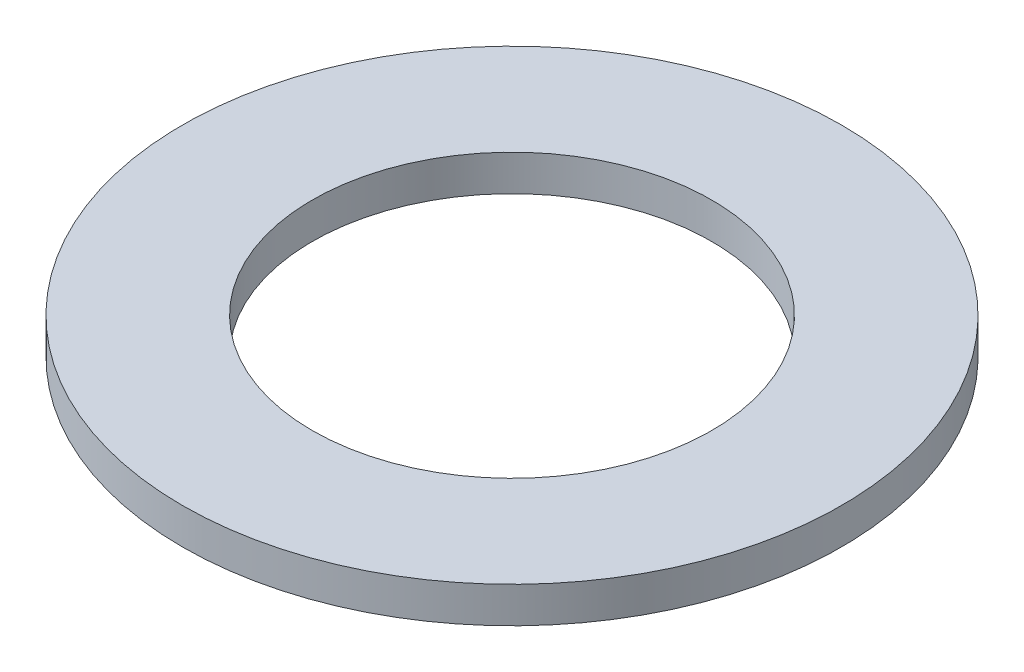
ISO-10303-21;
HEADER;
FILE_DESCRIPTION(('STEP AP214'),'2;1');
FILE_NAME('part.step','',(''),(''),'','','');
FILE_SCHEMA(('AUTOMOTIVE_DESIGN { 1 0 10303 214 1 1 1 1 }'));
ENDSEC;
DATA;
#1=APPLICATION_CONTEXT('core data for automotive mechanical design processes');
#2=APPLICATION_PROTOCOL_DEFINITION('international standard','automotive_design',2000,#1);
#3=PRODUCT_CONTEXT('',#1,'mechanical');
#4=PRODUCT('Part','Part','',(#3));
#5=PRODUCT_RELATED_PRODUCT_CATEGORY('part','',(#4));
#6=PRODUCT_DEFINITION_FORMATION('','',#4);
#7=PRODUCT_DEFINITION_CONTEXT('part definition',#1,'design');
#8=PRODUCT_DEFINITION('design','',#6,#7);
#9=PRODUCT_DEFINITION_SHAPE('','',#8);
#10=(LENGTH_UNIT() NAMED_UNIT(*) SI_UNIT(.MILLI.,.METRE.));
#11=(NAMED_UNIT(*) PLANE_ANGLE_UNIT() SI_UNIT($,.RADIAN.));
#12=(NAMED_UNIT(*) SI_UNIT($,.STERADIAN.) SOLID_ANGLE_UNIT());
#13=UNCERTAINTY_MEASURE_WITH_UNIT(LENGTH_MEASURE(1.E-05),#10,'distance_accuracy_value','');
#14=(GEOMETRIC_REPRESENTATION_CONTEXT(3) GLOBAL_UNCERTAINTY_ASSIGNED_CONTEXT((#13)) GLOBAL_UNIT_ASSIGNED_CONTEXT((#10,
#11,#12)) REPRESENTATION_CONTEXT('',''));
#15=CARTESIAN_POINT('',(0.,0.,0.));
#16=DIRECTION('',(0.,0.,1.));
#17=DIRECTION('',(1.,0.,0.));
#18=AXIS2_PLACEMENT_3D('',#15,#16,#17);
#19=CARTESIAN_POINT('',(0.,9.,0.));
#20=DIRECTION('',(0.,-1.,0.));
#21=DIRECTION('',(0.,0.,-1.));
#22=AXIS2_PLACEMENT_3D('',#19,#20,#21);
#23=CYLINDRICAL_SURFACE('',#22,82.5);
#24=CARTESIAN_POINT('',(0.,9.,0.));
#25=DIRECTION('',(0.,1.,0.));
#26=DIRECTION('',(0.,0.,1.));
#27=AXIS2_PLACEMENT_3D('',#24,#25,#26);
#28=CIRCLE('',#27,82.5);
#29=CARTESIAN_POINT('',(0.,9.,82.5));
#30=VERTEX_POINT('',#29);
#31=EDGE_CURVE('E10',#30,#30,#28,.T.);
#32=ORIENTED_EDGE('',*,*,#31,.F.);
#33=EDGE_LOOP('',(#32));
#34=FACE_BOUND('',#33,.T.);
#35=CARTESIAN_POINT('',(0.,0.,0.));
#36=DIRECTION('',(0.,1.,0.));
#37=DIRECTION('',(0.,0.,1.));
#38=AXIS2_PLACEMENT_3D('',#35,#36,#37);
#39=CIRCLE('',#38,82.5);
#40=CARTESIAN_POINT('',(0.,0.,82.5));
#41=VERTEX_POINT('',#40);
#42=EDGE_CURVE('E37',#41,#41,#39,.T.);
#43=ORIENTED_EDGE('',*,*,#42,.T.);
#44=EDGE_LOOP('',(#43));
#45=FACE_BOUND('',#44,.T.);
#46=ADVANCED_FACE('F40',(#34,#45),#23,.T.);
#47=CARTESIAN_POINT('',(0.,9.,0.));
#48=DIRECTION('',(0.,1.,0.));
#49=DIRECTION('',(0.,0.,1.));
#50=AXIS2_PLACEMENT_3D('',#47,#48,#49);
#51=PLANE('',#50);
#52=CARTESIAN_POINT('',(0.,9.,0.));
#53=DIRECTION('',(0.,1.,0.));
#54=DIRECTION('',(0.,0.,1.));
#55=AXIS2_PLACEMENT_3D('',#52,#53,#54);
#56=CIRCLE('',#55,50.);
#57=CARTESIAN_POINT('',(0.,9.,50.));
#58=VERTEX_POINT('',#57);
#59=EDGE_CURVE('E50',#58,#58,#56,.T.);
#60=ORIENTED_EDGE('',*,*,#59,.F.);
#61=EDGE_LOOP('',(#60));
#62=FACE_BOUND('',#61,.T.);
#63=ORIENTED_EDGE('',*,*,#31,.T.);
#64=EDGE_LOOP('',(#63));
#65=FACE_BOUND('',#64,.T.);
#66=ADVANCED_FACE('F59',(#62,#65),#51,.T.);
#67=CARTESIAN_POINT('',(0.,0.,0.));
#68=DIRECTION('',(0.,1.,0.));
#69=DIRECTION('',(0.,0.,1.));
#70=AXIS2_PLACEMENT_3D('',#67,#68,#69);
#71=PLANE('',#70);
#72=CARTESIAN_POINT('',(0.,0.,0.));
#73=DIRECTION('',(0.,1.,0.));
#74=DIRECTION('',(0.,0.,1.));
#75=AXIS2_PLACEMENT_3D('',#72,#73,#74);
#76=CIRCLE('',#75,50.);
#77=CARTESIAN_POINT('',(0.,0.,50.));
#78=VERTEX_POINT('',#77);
#79=EDGE_CURVE('E47',#78,#78,#76,.T.);
#80=ORIENTED_EDGE('',*,*,#79,.T.);
#81=EDGE_LOOP('',(#80));
#82=FACE_BOUND('',#81,.T.);
#83=ORIENTED_EDGE('',*,*,#42,.F.);
#84=EDGE_LOOP('',(#83));
#85=FACE_BOUND('',#84,.T.);
#86=ADVANCED_FACE('F58',(#82,#85),#71,.F.);
#87=CARTESIAN_POINT('',(0.,9.,0.));
#88=DIRECTION('',(0.,-1.,0.));
#89=DIRECTION('',(0.,0.,-1.));
#90=AXIS2_PLACEMENT_3D('',#87,#88,#89);
#91=CYLINDRICAL_SURFACE('',#90,50.);
#92=ORIENTED_EDGE('',*,*,#59,.T.);
#93=EDGE_LOOP('',(#92));
#94=FACE_BOUND('',#93,.T.);
#95=ORIENTED_EDGE('',*,*,#79,.F.);
#96=EDGE_LOOP('',(#95));
#97=FACE_BOUND('',#96,.T.);
#98=ADVANCED_FACE('F54',(#94,#97),#91,.F.);
#99=CLOSED_SHELL('',(#46,#66,#86,#98));
#100=MANIFOLD_SOLID_BREP('B2',#99);
#101=ADVANCED_BREP_SHAPE_REPRESENTATION('',(#18,#100),#14);
#102=SHAPE_DEFINITION_REPRESENTATION(#9,#101);
ENDSEC;
END-ISO-10303-21;
